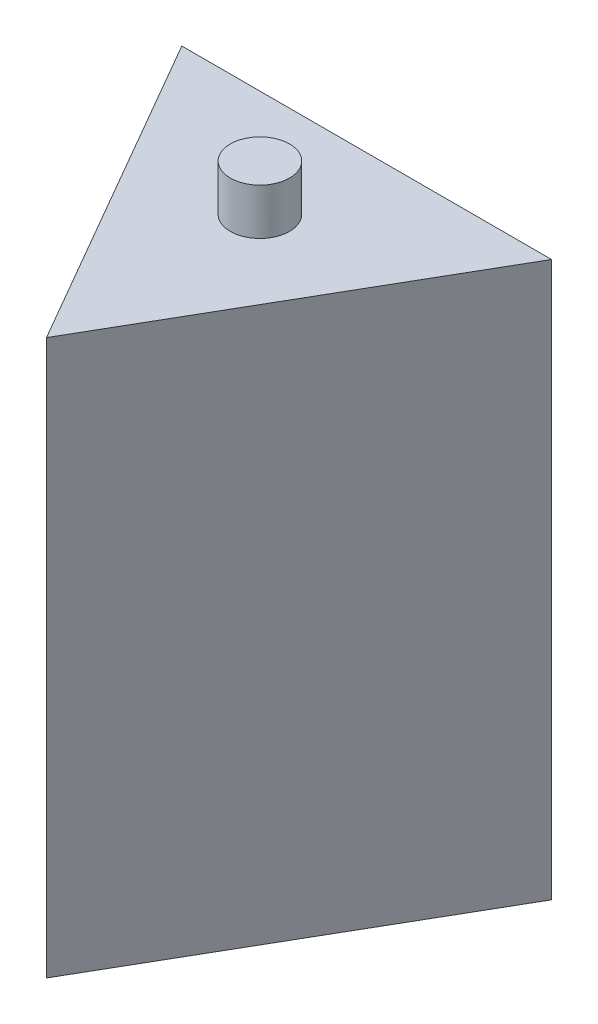
ISO-10303-21;
HEADER;
FILE_DESCRIPTION(('STEP AP214'),'2;1');
FILE_NAME('part.step','',(''),(''),'','','');
FILE_SCHEMA(('AUTOMOTIVE_DESIGN { 1 0 10303 214 1 1 1 1 }'));
ENDSEC;
DATA;
#1=APPLICATION_CONTEXT('core data for automotive mechanical design processes');
#2=APPLICATION_PROTOCOL_DEFINITION('international standard','automotive_design',2000,#1);
#3=PRODUCT_CONTEXT('',#1,'mechanical');
#4=PRODUCT('Part','Part','',(#3));
#5=PRODUCT_RELATED_PRODUCT_CATEGORY('part','',(#4));
#6=PRODUCT_DEFINITION_FORMATION('','',#4);
#7=PRODUCT_DEFINITION_CONTEXT('part definition',#1,'design');
#8=PRODUCT_DEFINITION('design','',#6,#7);
#9=PRODUCT_DEFINITION_SHAPE('','',#8);
#10=(LENGTH_UNIT() NAMED_UNIT(*) SI_UNIT(.MILLI.,.METRE.));
#11=(NAMED_UNIT(*) PLANE_ANGLE_UNIT() SI_UNIT($,.RADIAN.));
#12=(NAMED_UNIT(*) SI_UNIT($,.STERADIAN.) SOLID_ANGLE_UNIT());
#13=UNCERTAINTY_MEASURE_WITH_UNIT(LENGTH_MEASURE(1.E-05),#10,'distance_accuracy_value','');
#14=(GEOMETRIC_REPRESENTATION_CONTEXT(3) GLOBAL_UNCERTAINTY_ASSIGNED_CONTEXT((#13)) GLOBAL_UNIT_ASSIGNED_CONTEXT((#10,
#11,#12)) REPRESENTATION_CONTEXT('',''));
#15=CARTESIAN_POINT('',(0.,0.,0.));
#16=DIRECTION('',(0.,0.,1.));
#17=DIRECTION('',(1.,0.,0.));
#18=AXIS2_PLACEMENT_3D('',#15,#16,#17);
#19=CARTESIAN_POINT('',(0.,0.,0.));
#20=DIRECTION('',(0.,-1.,0.));
#21=DIRECTION('',(0.,0.,-1.));
#22=AXIS2_PLACEMENT_3D('',#19,#20,#21);
#23=PLANE('',#22);
#24=DIRECTION('',(0.5,0.,-0.866025403784439));
#25=VECTOR('',#24,1.);
#26=CARTESIAN_POINT('',(25.4,0.,-43.9940905122495));
#27=LINE('',#26,#25);
#28=CARTESIAN_POINT('',(0.,0.,0.));
#29=VERTEX_POINT('',#28);
#30=CARTESIAN_POINT('',(25.4,0.,-43.9940905122495));
#31=VERTEX_POINT('',#30);
#32=EDGE_CURVE('E138',#29,#31,#27,.T.);
#33=ORIENTED_EDGE('',*,*,#32,.F.);
#34=DIRECTION('',(0.5,0.,0.866025403784439));
#35=VECTOR('',#34,1.);
#36=CARTESIAN_POINT('',(0.,0.,0.));
#37=LINE('',#36,#35);
#38=CARTESIAN_POINT('',(-25.4,0.,-43.9940905122495));
#39=VERTEX_POINT('',#38);
#40=EDGE_CURVE('E81',#39,#29,#37,.T.);
#41=ORIENTED_EDGE('',*,*,#40,.F.);
#42=DIRECTION('',(-1.,0.,0.));
#43=VECTOR('',#42,1.);
#44=CARTESIAN_POINT('',(-25.4,0.,-43.9940905122495));
#45=LINE('',#44,#43);
#46=EDGE_CURVE('E155',#31,#39,#45,.T.);
#47=ORIENTED_EDGE('',*,*,#46,.F.);
#48=EDGE_LOOP('',(#33,#41,#47));
#49=FACE_BOUND('',#48,.T.);
#50=DIRECTION('',(-1.,0.,0.));
#51=VECTOR('',#50,1.);
#52=CARTESIAN_POINT('',(12.7,0.,-32.504393674833));
#53=LINE('',#52,#51);
#54=CARTESIAN_POINT('',(12.7,0.,-32.504393674833));
#55=VERTEX_POINT('',#54);
#56=CARTESIAN_POINT('',(-12.7,0.,-32.504393674833));
#57=VERTEX_POINT('',#56);
#58=EDGE_CURVE('E126',#55,#57,#53,.T.);
#59=ORIENTED_EDGE('',*,*,#58,.T.);
#60=DIRECTION('',(0.,0.,1.));
#61=VECTOR('',#60,1.);
#62=CARTESIAN_POINT('',(-12.7,0.,-26.154393674833));
#63=LINE('',#62,#61);
#64=CARTESIAN_POINT('',(-12.7,0.,-26.154393674833));
#65=VERTEX_POINT('',#64);
#66=EDGE_CURVE('E55',#57,#65,#63,.T.);
#67=ORIENTED_EDGE('',*,*,#66,.T.);
#68=DIRECTION('',(1.,0.,0.));
#69=VECTOR('',#68,1.);
#70=CARTESIAN_POINT('',(12.7,0.,-26.154393674833));
#71=LINE('',#70,#69);
#72=CARTESIAN_POINT('',(12.7,0.,-26.154393674833));
#73=VERTEX_POINT('',#72);
#74=EDGE_CURVE('E130',#65,#73,#71,.T.);
#75=ORIENTED_EDGE('',*,*,#74,.T.);
#76=DIRECTION('',(0.,0.,-1.));
#77=VECTOR('',#76,1.);
#78=CARTESIAN_POINT('',(12.7,0.,-26.154393674833));
#79=LINE('',#78,#77);
#80=EDGE_CURVE('E178',#73,#55,#79,.T.);
#81=ORIENTED_EDGE('',*,*,#80,.T.);
#82=EDGE_LOOP('',(#59,#67,#75,#81));
#83=FACE_BOUND('',#82,.T.);
#84=ADVANCED_FACE('F39',(#49,#83),#23,.T.);
#85=CARTESIAN_POINT('',(25.4,76.2,-43.9940905122495));
#86=DIRECTION('',(-0.866025403784439,0.,-0.5));
#87=DIRECTION('',(-0.5,0.,0.866025403784439));
#88=AXIS2_PLACEMENT_3D('',#85,#86,#87);
#89=PLANE('',#88);
#90=ORIENTED_EDGE('',*,*,#32,.T.);
#91=DIRECTION('',(0.,-1.,0.));
#92=VECTOR('',#91,1.);
#93=CARTESIAN_POINT('',(25.4,76.2,-43.9940905122495));
#94=LINE('',#93,#92);
#95=CARTESIAN_POINT('',(25.4,76.2,-43.9940905122495));
#96=VERTEX_POINT('',#95);
#97=EDGE_CURVE('E48',#96,#31,#94,.T.);
#98=ORIENTED_EDGE('',*,*,#97,.F.);
#99=DIRECTION('',(0.5,0.,-0.866025403784439));
#100=VECTOR('',#99,1.);
#101=CARTESIAN_POINT('',(25.4,76.2,-43.9940905122495));
#102=LINE('',#101,#100);
#103=CARTESIAN_POINT('',(0.,76.2,0.));
#104=VERTEX_POINT('',#103);
#105=EDGE_CURVE('E144',#104,#96,#102,.T.);
#106=ORIENTED_EDGE('',*,*,#105,.F.);
#107=DIRECTION('',(0.,-1.,0.));
#108=VECTOR('',#107,1.);
#109=CARTESIAN_POINT('',(0.,76.2,0.));
#110=LINE('',#109,#108);
#111=EDGE_CURVE('E151',#104,#29,#110,.T.);
#112=ORIENTED_EDGE('',*,*,#111,.T.);
#113=EDGE_LOOP('',(#90,#98,#106,#112));
#114=FACE_BOUND('',#113,.T.);
#115=ADVANCED_FACE('F41',(#114),#89,.F.);
#116=CARTESIAN_POINT('',(-25.4,76.2,-43.9940905122495));
#117=DIRECTION('',(0.,0.,1.));
#118=DIRECTION('',(1.,0.,0.));
#119=AXIS2_PLACEMENT_3D('',#116,#117,#118);
#120=PLANE('',#119);
#121=ORIENTED_EDGE('',*,*,#46,.T.);
#122=DIRECTION('',(0.,-1.,0.));
#123=VECTOR('',#122,1.);
#124=CARTESIAN_POINT('',(-25.4,76.2,-43.9940905122495));
#125=LINE('',#124,#123);
#126=CARTESIAN_POINT('',(-25.4,76.2,-43.9940905122495));
#127=VERTEX_POINT('',#126);
#128=EDGE_CURVE('E162',#127,#39,#125,.T.);
#129=ORIENTED_EDGE('',*,*,#128,.F.);
#130=DIRECTION('',(-1.,0.,0.));
#131=VECTOR('',#130,1.);
#132=CARTESIAN_POINT('',(-25.4,76.2,-43.9940905122495));
#133=LINE('',#132,#131);
#134=EDGE_CURVE('E87',#96,#127,#133,.T.);
#135=ORIENTED_EDGE('',*,*,#134,.F.);
#136=ORIENTED_EDGE('',*,*,#97,.T.);
#137=EDGE_LOOP('',(#121,#129,#135,#136));
#138=FACE_BOUND('',#137,.T.);
#139=ADVANCED_FACE('F166',(#138),#120,.F.);
#140=CARTESIAN_POINT('',(0.,76.2,0.));
#141=DIRECTION('',(0.866025403784439,0.,-0.5));
#142=DIRECTION('',(-0.5,0.,-0.866025403784439));
#143=AXIS2_PLACEMENT_3D('',#140,#141,#142);
#144=PLANE('',#143);
#145=ORIENTED_EDGE('',*,*,#40,.T.);
#146=ORIENTED_EDGE('',*,*,#111,.F.);
#147=DIRECTION('',(0.5,0.,0.866025403784439));
#148=VECTOR('',#147,1.);
#149=CARTESIAN_POINT('',(0.,76.2,0.));
#150=LINE('',#149,#148);
#151=EDGE_CURVE('E64',#127,#104,#150,.T.);
#152=ORIENTED_EDGE('',*,*,#151,.F.);
#153=ORIENTED_EDGE('',*,*,#128,.T.);
#154=EDGE_LOOP('',(#145,#146,#152,#153));
#155=FACE_BOUND('',#154,.T.);
#156=ADVANCED_FACE('F223',(#155),#144,.F.);
#157=CARTESIAN_POINT('',(0.,76.2,0.));
#158=DIRECTION('',(0.,-1.,0.));
#159=DIRECTION('',(0.,0.,-1.));
#160=AXIS2_PLACEMENT_3D('',#157,#158,#159);
#161=PLANE('',#160);
#162=CARTESIAN_POINT('',(0.,76.2,-29.329393674833));
#163=DIRECTION('',(0.,-1.,0.));
#164=DIRECTION('',(0.,0.,-1.));
#165=AXIS2_PLACEMENT_3D('',#162,#163,#164);
#166=CIRCLE('',#165,4.064);
#167=CARTESIAN_POINT('',(0.,76.2,-33.393393674833));
#168=VERTEX_POINT('',#167);
#169=EDGE_CURVE('E11',#168,#168,#166,.F.);
#170=ORIENTED_EDGE('',*,*,#169,.F.);
#171=EDGE_LOOP('',(#170));
#172=FACE_BOUND('',#171,.T.);
#173=ORIENTED_EDGE('',*,*,#105,.T.);
#174=ORIENTED_EDGE('',*,*,#134,.T.);
#175=ORIENTED_EDGE('',*,*,#151,.T.);
#176=EDGE_LOOP('',(#173,#174,#175));
#177=FACE_BOUND('',#176,.T.);
#178=ADVANCED_FACE('F220',(#172,#177),#161,.F.);
#179=CARTESIAN_POINT('',(0.,82.55,-29.329393674833));
#180=DIRECTION('',(0.,-1.,0.));
#181=DIRECTION('',(0.,0.,-1.));
#182=AXIS2_PLACEMENT_3D('',#179,#180,#181);
#183=CYLINDRICAL_SURFACE('',#182,4.064);
#184=CARTESIAN_POINT('',(0.,82.55,-29.329393674833));
#185=DIRECTION('',(0.,1.,0.));
#186=DIRECTION('',(0.,0.,1.));
#187=AXIS2_PLACEMENT_3D('',#184,#185,#186);
#188=CIRCLE('',#187,4.064);
#189=CARTESIAN_POINT('',(0.,82.55,-25.265393674833));
#190=VERTEX_POINT('',#189);
#191=EDGE_CURVE('E132',#190,#190,#188,.T.);
#192=ORIENTED_EDGE('',*,*,#191,.F.);
#193=EDGE_LOOP('',(#192));
#194=FACE_BOUND('',#193,.T.);
#195=ORIENTED_EDGE('',*,*,#169,.T.);
#196=EDGE_LOOP('',(#195));
#197=FACE_BOUND('',#196,.T.);
#198=ADVANCED_FACE('F216',(#194,#197),#183,.T.);
#199=CARTESIAN_POINT('',(0.,82.55,-29.329393674833));
#200=DIRECTION('',(0.,1.,0.));
#201=DIRECTION('',(0.,0.,1.));
#202=AXIS2_PLACEMENT_3D('',#199,#200,#201);
#203=PLANE('',#202);
#204=ORIENTED_EDGE('',*,*,#191,.T.);
#205=EDGE_LOOP('',(#204));
#206=FACE_BOUND('',#205,.T.);
#207=ADVANCED_FACE('F213',(#206),#203,.T.);
#208=CARTESIAN_POINT('',(-12.7,25.4,-26.154393674833));
#209=DIRECTION('',(1.,0.,0.));
#210=DIRECTION('',(0.,0.,-1.));
#211=AXIS2_PLACEMENT_3D('',#208,#209,#210);
#212=PLANE('',#211);
#213=ORIENTED_EDGE('',*,*,#66,.F.);
#214=DIRECTION('',(0.,-1.,0.));
#215=VECTOR('',#214,1.);
#216=CARTESIAN_POINT('',(-12.7,25.4,-32.504393674833));
#217=LINE('',#216,#215);
#218=CARTESIAN_POINT('',(-12.7,25.4,-32.504393674833));
#219=VERTEX_POINT('',#218);
#220=EDGE_CURVE('E124',#219,#57,#217,.T.);
#221=ORIENTED_EDGE('',*,*,#220,.F.);
#222=DIRECTION('',(0.,0.,1.));
#223=VECTOR('',#222,1.);
#224=CARTESIAN_POINT('',(-12.7,25.4,-26.154393674833));
#225=LINE('',#224,#223);
#226=CARTESIAN_POINT('',(-12.7,25.4,-26.154393674833));
#227=VERTEX_POINT('',#226);
#228=EDGE_CURVE('E115',#219,#227,#225,.T.);
#229=ORIENTED_EDGE('',*,*,#228,.T.);
#230=DIRECTION('',(0.,-1.,0.));
#231=VECTOR('',#230,1.);
#232=CARTESIAN_POINT('',(-12.7,25.4,-26.154393674833));
#233=LINE('',#232,#231);
#234=EDGE_CURVE('E123',#227,#65,#233,.T.);
#235=ORIENTED_EDGE('',*,*,#234,.T.);
#236=EDGE_LOOP('',(#213,#221,#229,#235));
#237=FACE_BOUND('',#236,.T.);
#238=ADVANCED_FACE('F122',(#237),#212,.T.);
#239=CARTESIAN_POINT('',(12.7,25.4,-26.154393674833));
#240=DIRECTION('',(0.,0.,-1.));
#241=DIRECTION('',(-1.,0.,0.));
#242=AXIS2_PLACEMENT_3D('',#239,#240,#241);
#243=PLANE('',#242);
#244=ORIENTED_EDGE('',*,*,#74,.F.);
#245=ORIENTED_EDGE('',*,*,#234,.F.);
#246=DIRECTION('',(1.,0.,0.));
#247=VECTOR('',#246,1.);
#248=CARTESIAN_POINT('',(12.7,25.4,-26.154393674833));
#249=LINE('',#248,#247);
#250=CARTESIAN_POINT('',(12.7,25.4,-26.154393674833));
#251=VERTEX_POINT('',#250);
#252=EDGE_CURVE('E111',#227,#251,#249,.T.);
#253=ORIENTED_EDGE('',*,*,#252,.T.);
#254=DIRECTION('',(0.,-1.,0.));
#255=VECTOR('',#254,1.);
#256=CARTESIAN_POINT('',(12.7,25.4,-26.154393674833));
#257=LINE('',#256,#255);
#258=EDGE_CURVE('E133',#251,#73,#257,.T.);
#259=ORIENTED_EDGE('',*,*,#258,.T.);
#260=EDGE_LOOP('',(#244,#245,#253,#259));
#261=FACE_BOUND('',#260,.T.);
#262=ADVANCED_FACE('F128',(#261),#243,.T.);
#263=CARTESIAN_POINT('',(12.7,25.4,-26.154393674833));
#264=DIRECTION('',(-1.,0.,0.));
#265=DIRECTION('',(0.,0.,1.));
#266=AXIS2_PLACEMENT_3D('',#263,#264,#265);
#267=PLANE('',#266);
#268=ORIENTED_EDGE('',*,*,#80,.F.);
#269=ORIENTED_EDGE('',*,*,#258,.F.);
#270=DIRECTION('',(0.,0.,-1.));
#271=VECTOR('',#270,1.);
#272=CARTESIAN_POINT('',(12.7,25.4,-26.154393674833));
#273=LINE('',#272,#271);
#274=CARTESIAN_POINT('',(12.7,25.4,-32.504393674833));
#275=VERTEX_POINT('',#274);
#276=EDGE_CURVE('E116',#251,#275,#273,.T.);
#277=ORIENTED_EDGE('',*,*,#276,.T.);
#278=DIRECTION('',(0.,-1.,0.));
#279=VECTOR('',#278,1.);
#280=CARTESIAN_POINT('',(12.7,25.4,-32.504393674833));
#281=LINE('',#280,#279);
#282=EDGE_CURVE('E140',#275,#55,#281,.T.);
#283=ORIENTED_EDGE('',*,*,#282,.T.);
#284=EDGE_LOOP('',(#268,#269,#277,#283));
#285=FACE_BOUND('',#284,.T.);
#286=ADVANCED_FACE('F191',(#285),#267,.T.);
#287=CARTESIAN_POINT('',(12.7,25.4,-32.504393674833));
#288=DIRECTION('',(0.,0.,1.));
#289=DIRECTION('',(1.,0.,0.));
#290=AXIS2_PLACEMENT_3D('',#287,#288,#289);
#291=PLANE('',#290);
#292=ORIENTED_EDGE('',*,*,#58,.F.);
#293=ORIENTED_EDGE('',*,*,#282,.F.);
#294=DIRECTION('',(-1.,0.,0.));
#295=VECTOR('',#294,1.);
#296=CARTESIAN_POINT('',(12.7,25.4,-32.504393674833));
#297=LINE('',#296,#295);
#298=EDGE_CURVE('E188',#275,#219,#297,.T.);
#299=ORIENTED_EDGE('',*,*,#298,.T.);
#300=ORIENTED_EDGE('',*,*,#220,.T.);
#301=EDGE_LOOP('',(#292,#293,#299,#300));
#302=FACE_BOUND('',#301,.T.);
#303=ADVANCED_FACE('F192',(#302),#291,.T.);
#304=CARTESIAN_POINT('',(0.,25.4,0.));
#305=DIRECTION('',(0.,1.,0.));
#306=DIRECTION('',(0.,0.,1.));
#307=AXIS2_PLACEMENT_3D('',#304,#305,#306);
#308=PLANE('',#307);
#309=ORIENTED_EDGE('',*,*,#228,.F.);
#310=ORIENTED_EDGE('',*,*,#298,.F.);
#311=ORIENTED_EDGE('',*,*,#276,.F.);
#312=ORIENTED_EDGE('',*,*,#252,.F.);
#313=EDGE_LOOP('',(#309,#310,#311,#312));
#314=FACE_BOUND('',#313,.T.);
#315=ADVANCED_FACE('F113',(#314),#308,.F.);
#316=CLOSED_SHELL('',(#84,#115,#139,#156,#178,#198,#207,#238,#262,#286,#303,#315));
#317=MANIFOLD_SOLID_BREP('B2',#316);
#318=ADVANCED_BREP_SHAPE_REPRESENTATION('',(#18,#317),#14);
#319=SHAPE_DEFINITION_REPRESENTATION(#9,#318);
ENDSEC;
END-ISO-10303-21;
